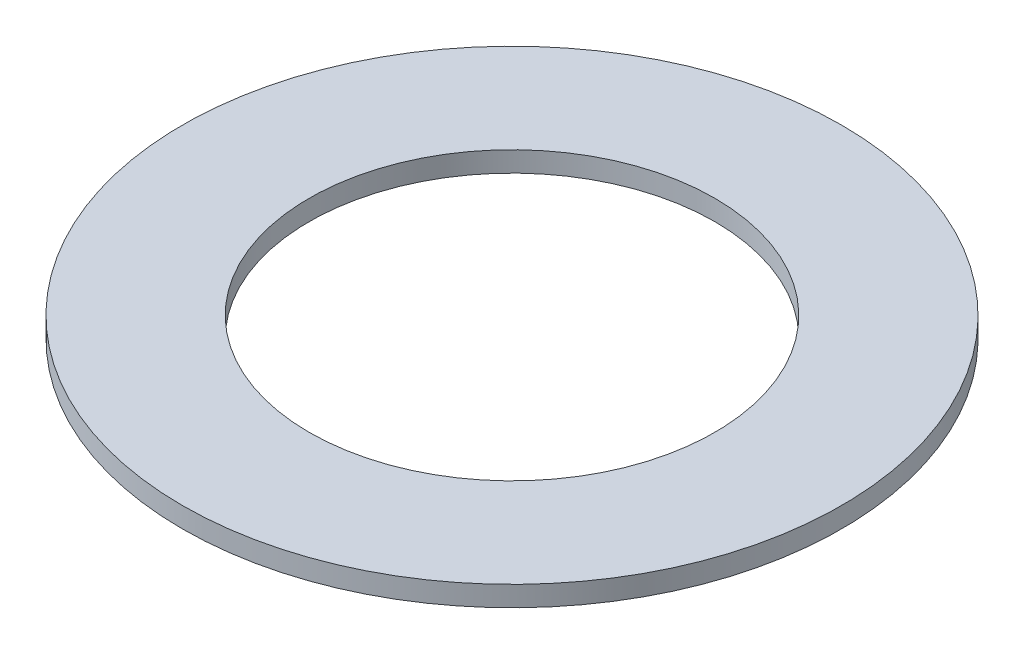
ISO-10303-21;
HEADER;
FILE_DESCRIPTION(('STEP AP214'),'2;1');
FILE_NAME('part.step','',(''),(''),'','','');
FILE_SCHEMA(('AUTOMOTIVE_DESIGN { 1 0 10303 214 1 1 1 1 }'));
ENDSEC;
DATA;
#1=APPLICATION_CONTEXT('core data for automotive mechanical design processes');
#2=APPLICATION_PROTOCOL_DEFINITION('international standard','automotive_design',2000,#1);
#3=PRODUCT_CONTEXT('',#1,'mechanical');
#4=PRODUCT('Part','Part','',(#3));
#5=PRODUCT_RELATED_PRODUCT_CATEGORY('part','',(#4));
#6=PRODUCT_DEFINITION_FORMATION('','',#4);
#7=PRODUCT_DEFINITION_CONTEXT('part definition',#1,'design');
#8=PRODUCT_DEFINITION('design','',#6,#7);
#9=PRODUCT_DEFINITION_SHAPE('','',#8);
#10=(LENGTH_UNIT() NAMED_UNIT(*) SI_UNIT(.MILLI.,.METRE.));
#11=(NAMED_UNIT(*) PLANE_ANGLE_UNIT() SI_UNIT($,.RADIAN.));
#12=(NAMED_UNIT(*) SI_UNIT($,.STERADIAN.) SOLID_ANGLE_UNIT());
#13=UNCERTAINTY_MEASURE_WITH_UNIT(LENGTH_MEASURE(1.E-05),#10,'distance_accuracy_value','');
#14=(GEOMETRIC_REPRESENTATION_CONTEXT(3) GLOBAL_UNCERTAINTY_ASSIGNED_CONTEXT((#13)) GLOBAL_UNIT_ASSIGNED_CONTEXT((#10,
#11,#12)) REPRESENTATION_CONTEXT('',''));
#15=CARTESIAN_POINT('',(0.,0.,0.));
#16=DIRECTION('',(0.,0.,1.));
#17=DIRECTION('',(1.,0.,0.));
#18=AXIS2_PLACEMENT_3D('',#15,#16,#17);
#19=CARTESIAN_POINT('',(0.,4.,0.));
#20=DIRECTION('',(0.,-1.,0.));
#21=DIRECTION('',(0.,0.,-1.));
#22=AXIS2_PLACEMENT_3D('',#19,#20,#21);
#23=CYLINDRICAL_SURFACE('',#22,65.);
#24=CARTESIAN_POINT('',(0.,4.,0.));
#25=DIRECTION('',(0.,1.,0.));
#26=DIRECTION('',(0.,0.,1.));
#27=AXIS2_PLACEMENT_3D('',#24,#25,#26);
#28=CIRCLE('',#27,65.);
#29=CARTESIAN_POINT('',(0.,4.,65.));
#30=VERTEX_POINT('',#29);
#31=EDGE_CURVE('E10',#30,#30,#28,.T.);
#32=ORIENTED_EDGE('',*,*,#31,.F.);
#33=EDGE_LOOP('',(#32));
#34=FACE_BOUND('',#33,.T.);
#35=CARTESIAN_POINT('',(0.,0.,0.));
#36=DIRECTION('',(0.,1.,0.));
#37=DIRECTION('',(0.,0.,1.));
#38=AXIS2_PLACEMENT_3D('',#35,#36,#37);
#39=CIRCLE('',#38,65.);
#40=CARTESIAN_POINT('',(0.,0.,65.));
#41=VERTEX_POINT('',#40);
#42=EDGE_CURVE('E37',#41,#41,#39,.T.);
#43=ORIENTED_EDGE('',*,*,#42,.T.);
#44=EDGE_LOOP('',(#43));
#45=FACE_BOUND('',#44,.T.);
#46=ADVANCED_FACE('F40',(#34,#45),#23,.T.);
#47=CARTESIAN_POINT('',(0.,4.,0.));
#48=DIRECTION('',(0.,1.,0.));
#49=DIRECTION('',(0.,0.,1.));
#50=AXIS2_PLACEMENT_3D('',#47,#48,#49);
#51=PLANE('',#50);
#52=CARTESIAN_POINT('',(0.,4.,0.));
#53=DIRECTION('',(0.,1.,0.));
#54=DIRECTION('',(0.,0.,1.));
#55=AXIS2_PLACEMENT_3D('',#52,#53,#54);
#56=CIRCLE('',#55,40.);
#57=CARTESIAN_POINT('',(0.,4.,40.));
#58=VERTEX_POINT('',#57);
#59=EDGE_CURVE('E50',#58,#58,#56,.T.);
#60=ORIENTED_EDGE('',*,*,#59,.F.);
#61=EDGE_LOOP('',(#60));
#62=FACE_BOUND('',#61,.T.);
#63=ORIENTED_EDGE('',*,*,#31,.T.);
#64=EDGE_LOOP('',(#63));
#65=FACE_BOUND('',#64,.T.);
#66=ADVANCED_FACE('F59',(#62,#65),#51,.T.);
#67=CARTESIAN_POINT('',(0.,0.,0.));
#68=DIRECTION('',(0.,1.,0.));
#69=DIRECTION('',(0.,0.,1.));
#70=AXIS2_PLACEMENT_3D('',#67,#68,#69);
#71=PLANE('',#70);
#72=CARTESIAN_POINT('',(0.,0.,0.));
#73=DIRECTION('',(0.,1.,0.));
#74=DIRECTION('',(0.,0.,1.));
#75=AXIS2_PLACEMENT_3D('',#72,#73,#74);
#76=CIRCLE('',#75,40.);
#77=CARTESIAN_POINT('',(0.,0.,40.));
#78=VERTEX_POINT('',#77);
#79=EDGE_CURVE('E47',#78,#78,#76,.T.);
#80=ORIENTED_EDGE('',*,*,#79,.T.);
#81=EDGE_LOOP('',(#80));
#82=FACE_BOUND('',#81,.T.);
#83=ORIENTED_EDGE('',*,*,#42,.F.);
#84=EDGE_LOOP('',(#83));
#85=FACE_BOUND('',#84,.T.);
#86=ADVANCED_FACE('F58',(#82,#85),#71,.F.);
#87=CARTESIAN_POINT('',(0.,4.,0.));
#88=DIRECTION('',(0.,-1.,0.));
#89=DIRECTION('',(0.,0.,-1.));
#90=AXIS2_PLACEMENT_3D('',#87,#88,#89);
#91=CYLINDRICAL_SURFACE('',#90,40.);
#92=ORIENTED_EDGE('',*,*,#59,.T.);
#93=EDGE_LOOP('',(#92));
#94=FACE_BOUND('',#93,.T.);
#95=ORIENTED_EDGE('',*,*,#79,.F.);
#96=EDGE_LOOP('',(#95));
#97=FACE_BOUND('',#96,.T.);
#98=ADVANCED_FACE('F54',(#94,#97),#91,.F.);
#99=CLOSED_SHELL('',(#46,#66,#86,#98));
#100=MANIFOLD_SOLID_BREP('B2',#99);
#101=ADVANCED_BREP_SHAPE_REPRESENTATION('',(#18,#100),#14);
#102=SHAPE_DEFINITION_REPRESENTATION(#9,#101);
ENDSEC;
END-ISO-10303-21;
